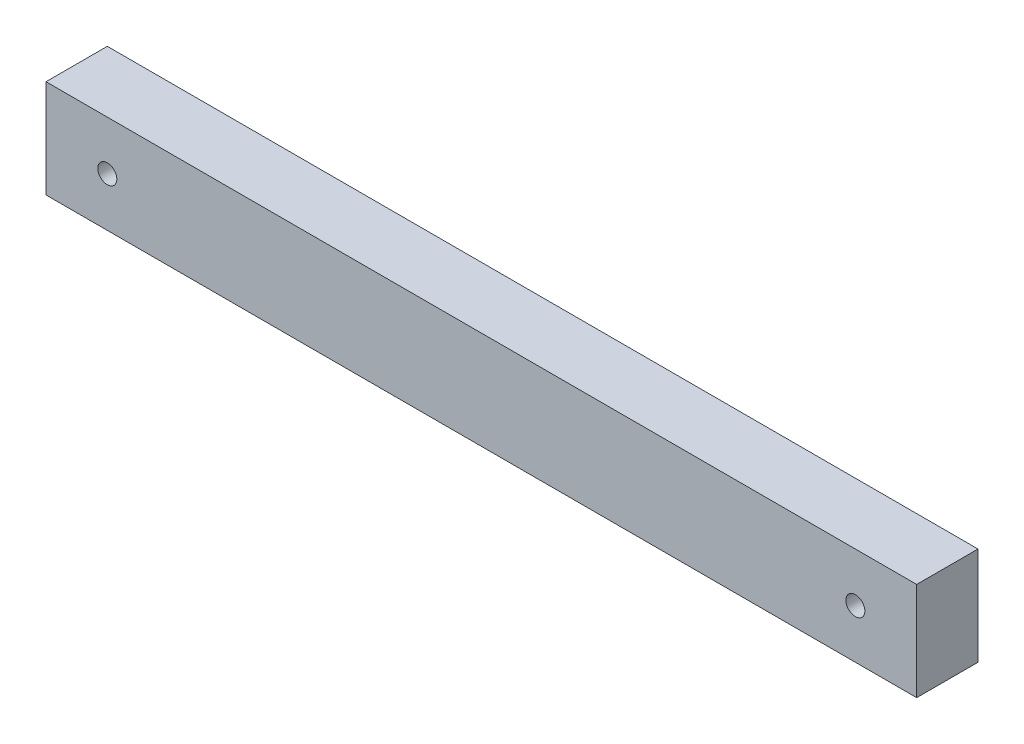
ISO-10303-21;
HEADER;
FILE_DESCRIPTION(('STEP AP214'),'2;1');
FILE_NAME('part.step','',(''),(''),'','','');
FILE_SCHEMA(('AUTOMOTIVE_DESIGN { 1 0 10303 214 1 1 1 1 }'));
ENDSEC;
DATA;
#1=APPLICATION_CONTEXT('core data for automotive mechanical design processes');
#2=APPLICATION_PROTOCOL_DEFINITION('international standard','automotive_design',2000,#1);
#3=PRODUCT_CONTEXT('',#1,'mechanical');
#4=PRODUCT('Part','Part','',(#3));
#5=PRODUCT_RELATED_PRODUCT_CATEGORY('part','',(#4));
#6=PRODUCT_DEFINITION_FORMATION('','',#4);
#7=PRODUCT_DEFINITION_CONTEXT('part definition',#1,'design');
#8=PRODUCT_DEFINITION('design','',#6,#7);
#9=PRODUCT_DEFINITION_SHAPE('','',#8);
#10=(LENGTH_UNIT() NAMED_UNIT(*) SI_UNIT(.MILLI.,.METRE.));
#11=(NAMED_UNIT(*) PLANE_ANGLE_UNIT() SI_UNIT($,.RADIAN.));
#12=(NAMED_UNIT(*) SI_UNIT($,.STERADIAN.) SOLID_ANGLE_UNIT());
#13=UNCERTAINTY_MEASURE_WITH_UNIT(LENGTH_MEASURE(1.E-05),#10,'distance_accuracy_value','');
#14=(GEOMETRIC_REPRESENTATION_CONTEXT(3) GLOBAL_UNCERTAINTY_ASSIGNED_CONTEXT((#13)) GLOBAL_UNIT_ASSIGNED_CONTEXT((#10,
#11,#12)) REPRESENTATION_CONTEXT('',''));
#15=CARTESIAN_POINT('',(0.,0.,0.));
#16=DIRECTION('',(0.,0.,1.));
#17=DIRECTION('',(1.,0.,0.));
#18=AXIS2_PLACEMENT_3D('',#15,#16,#17);
#19=CARTESIAN_POINT('',(0.,0.,10.));
#20=DIRECTION('',(0.,0.,1.));
#21=DIRECTION('',(1.,0.,0.));
#22=AXIS2_PLACEMENT_3D('',#19,#20,#21);
#23=PLANE('',#22);
#24=CARTESIAN_POINT('',(-61.,0.,10.));
#25=DIRECTION('',(0.,0.,1.));
#26=DIRECTION('',(1.,0.,0.));
#27=AXIS2_PLACEMENT_3D('',#24,#25,#26);
#28=CIRCLE('',#27,1.54999999999999);
#29=CARTESIAN_POINT('',(-59.45,0.,10.));
#30=VERTEX_POINT('',#29);
#31=EDGE_CURVE('E105',#30,#30,#28,.T.);
#32=ORIENTED_EDGE('',*,*,#31,.F.);
#33=EDGE_LOOP('',(#32));
#34=FACE_BOUND('',#33,.T.);
#35=DIRECTION('',(0.,1.,0.));
#36=VECTOR('',#35,1.);
#37=CARTESIAN_POINT('',(71.,8.00000000000004,10.));
#38=LINE('',#37,#36);
#39=CARTESIAN_POINT('',(71.,-8.00000000000004,10.));
#40=VERTEX_POINT('',#39);
#41=CARTESIAN_POINT('',(71.,8.00000000000004,10.));
#42=VERTEX_POINT('',#41);
#43=EDGE_CURVE('E90',#40,#42,#38,.T.);
#44=ORIENTED_EDGE('',*,*,#43,.T.);
#45=DIRECTION('',(-1.,0.,0.));
#46=VECTOR('',#45,1.);
#47=CARTESIAN_POINT('',(-71.,8.,10.));
#48=LINE('',#47,#46);
#49=CARTESIAN_POINT('',(-71.,8.,10.));
#50=VERTEX_POINT('',#49);
#51=EDGE_CURVE('E85',#42,#50,#48,.T.);
#52=ORIENTED_EDGE('',*,*,#51,.T.);
#53=DIRECTION('',(0.,-1.,0.));
#54=VECTOR('',#53,1.);
#55=CARTESIAN_POINT('',(-71.,8.,10.));
#56=LINE('',#55,#54);
#57=CARTESIAN_POINT('',(-71.,-8.,10.));
#58=VERTEX_POINT('',#57);
#59=EDGE_CURVE('E88',#50,#58,#56,.T.);
#60=ORIENTED_EDGE('',*,*,#59,.T.);
#61=DIRECTION('',(1.,0.,0.));
#62=VECTOR('',#61,1.);
#63=CARTESIAN_POINT('',(-71.,-8.,10.));
#64=LINE('',#63,#62);
#65=EDGE_CURVE('E55',#58,#40,#64,.T.);
#66=ORIENTED_EDGE('',*,*,#65,.T.);
#67=EDGE_LOOP('',(#44,#52,#60,#66));
#68=FACE_BOUND('',#67,.T.);
#69=CARTESIAN_POINT('',(61.,0.,10.));
#70=DIRECTION('',(0.,0.,1.));
#71=DIRECTION('',(1.,0.,0.));
#72=AXIS2_PLACEMENT_3D('',#69,#70,#71);
#73=CIRCLE('',#72,1.54999999999999);
#74=CARTESIAN_POINT('',(62.55,0.,10.));
#75=VERTEX_POINT('',#74);
#76=EDGE_CURVE('E120',#75,#75,#73,.T.);
#77=ORIENTED_EDGE('',*,*,#76,.F.);
#78=EDGE_LOOP('',(#77));
#79=FACE_BOUND('',#78,.T.);
#80=ADVANCED_FACE('F38',(#34,#68,#79),#23,.T.);
#81=CARTESIAN_POINT('',(0.,0.,0.));
#82=DIRECTION('',(0.,0.,1.));
#83=DIRECTION('',(1.,0.,0.));
#84=AXIS2_PLACEMENT_3D('',#81,#82,#83);
#85=PLANE('',#84);
#86=DIRECTION('',(0.,1.,0.));
#87=VECTOR('',#86,1.);
#88=CARTESIAN_POINT('',(71.,8.00000000000004,0.));
#89=LINE('',#88,#87);
#90=CARTESIAN_POINT('',(71.,-8.00000000000004,0.));
#91=VERTEX_POINT('',#90);
#92=CARTESIAN_POINT('',(71.,8.00000000000004,0.));
#93=VERTEX_POINT('',#92);
#94=EDGE_CURVE('E102',#91,#93,#89,.T.);
#95=ORIENTED_EDGE('',*,*,#94,.F.);
#96=DIRECTION('',(1.,0.,0.));
#97=VECTOR('',#96,1.);
#98=CARTESIAN_POINT('',(-71.,-8.,0.));
#99=LINE('',#98,#97);
#100=CARTESIAN_POINT('',(-71.,-8.,0.));
#101=VERTEX_POINT('',#100);
#102=EDGE_CURVE('E78',#101,#91,#99,.T.);
#103=ORIENTED_EDGE('',*,*,#102,.F.);
#104=DIRECTION('',(0.,-1.,0.));
#105=VECTOR('',#104,1.);
#106=CARTESIAN_POINT('',(-71.,8.,0.));
#107=LINE('',#106,#105);
#108=CARTESIAN_POINT('',(-71.,8.,0.));
#109=VERTEX_POINT('',#108);
#110=EDGE_CURVE('E72',#109,#101,#107,.T.);
#111=ORIENTED_EDGE('',*,*,#110,.F.);
#112=DIRECTION('',(-1.,0.,0.));
#113=VECTOR('',#112,1.);
#114=CARTESIAN_POINT('',(-71.,8.,0.));
#115=LINE('',#114,#113);
#116=EDGE_CURVE('E94',#93,#109,#115,.T.);
#117=ORIENTED_EDGE('',*,*,#116,.F.);
#118=EDGE_LOOP('',(#95,#103,#111,#117));
#119=FACE_BOUND('',#118,.T.);
#120=CARTESIAN_POINT('',(-61.,0.,0.));
#121=DIRECTION('',(0.,0.,1.));
#122=DIRECTION('',(1.,0.,0.));
#123=AXIS2_PLACEMENT_3D('',#120,#121,#122);
#124=CIRCLE('',#123,1.54999999999999);
#125=CARTESIAN_POINT('',(-59.45,0.,0.));
#126=VERTEX_POINT('',#125);
#127=EDGE_CURVE('E117',#126,#126,#124,.T.);
#128=ORIENTED_EDGE('',*,*,#127,.T.);
#129=EDGE_LOOP('',(#128));
#130=FACE_BOUND('',#129,.T.);
#131=CARTESIAN_POINT('',(61.,0.,0.));
#132=DIRECTION('',(0.,0.,1.));
#133=DIRECTION('',(1.,0.,0.));
#134=AXIS2_PLACEMENT_3D('',#131,#132,#133);
#135=CIRCLE('',#134,1.54999999999999);
#136=CARTESIAN_POINT('',(62.55,0.,0.));
#137=VERTEX_POINT('',#136);
#138=EDGE_CURVE('E123',#137,#137,#135,.T.);
#139=ORIENTED_EDGE('',*,*,#138,.T.);
#140=EDGE_LOOP('',(#139));
#141=FACE_BOUND('',#140,.T.);
#142=ADVANCED_FACE('F113',(#119,#130,#141),#85,.F.);
#143=CARTESIAN_POINT('',(71.,8.00000000000004,10.));
#144=DIRECTION('',(-1.,0.,0.));
#145=DIRECTION('',(0.,0.,1.));
#146=AXIS2_PLACEMENT_3D('',#143,#144,#145);
#147=PLANE('',#146);
#148=ORIENTED_EDGE('',*,*,#94,.T.);
#149=DIRECTION('',(0.,0.,-1.));
#150=VECTOR('',#149,1.);
#151=CARTESIAN_POINT('',(71.,8.00000000000004,10.));
#152=LINE('',#151,#150);
#153=EDGE_CURVE('E11',#42,#93,#152,.T.);
#154=ORIENTED_EDGE('',*,*,#153,.F.);
#155=ORIENTED_EDGE('',*,*,#43,.F.);
#156=DIRECTION('',(0.,0.,-1.));
#157=VECTOR('',#156,1.);
#158=CARTESIAN_POINT('',(71.,-8.00000000000004,10.));
#159=LINE('',#158,#157);
#160=EDGE_CURVE('E98',#40,#91,#159,.T.);
#161=ORIENTED_EDGE('',*,*,#160,.T.);
#162=EDGE_LOOP('',(#148,#154,#155,#161));
#163=FACE_BOUND('',#162,.T.);
#164=ADVANCED_FACE('F40',(#163),#147,.F.);
#165=CARTESIAN_POINT('',(-71.,8.,10.));
#166=DIRECTION('',(0.,-1.,0.));
#167=DIRECTION('',(1.,0.,0.));
#168=AXIS2_PLACEMENT_3D('',#165,#166,#167);
#169=PLANE('',#168);
#170=ORIENTED_EDGE('',*,*,#116,.T.);
#171=DIRECTION('',(0.,0.,-1.));
#172=VECTOR('',#171,1.);
#173=CARTESIAN_POINT('',(-71.,8.,10.));
#174=LINE('',#173,#172);
#175=EDGE_CURVE('E47',#50,#109,#174,.T.);
#176=ORIENTED_EDGE('',*,*,#175,.F.);
#177=ORIENTED_EDGE('',*,*,#51,.F.);
#178=ORIENTED_EDGE('',*,*,#153,.T.);
#179=EDGE_LOOP('',(#170,#176,#177,#178));
#180=FACE_BOUND('',#179,.T.);
#181=ADVANCED_FACE('F93',(#180),#169,.F.);
#182=CARTESIAN_POINT('',(-71.,8.,10.));
#183=DIRECTION('',(1.,0.,0.));
#184=DIRECTION('',(0.,0.,-1.));
#185=AXIS2_PLACEMENT_3D('',#182,#183,#184);
#186=PLANE('',#185);
#187=ORIENTED_EDGE('',*,*,#110,.T.);
#188=DIRECTION('',(0.,0.,-1.));
#189=VECTOR('',#188,1.);
#190=CARTESIAN_POINT('',(-71.,-8.,10.));
#191=LINE('',#190,#189);
#192=EDGE_CURVE('E95',#58,#101,#191,.T.);
#193=ORIENTED_EDGE('',*,*,#192,.F.);
#194=ORIENTED_EDGE('',*,*,#59,.F.);
#195=ORIENTED_EDGE('',*,*,#175,.T.);
#196=EDGE_LOOP('',(#187,#193,#194,#195));
#197=FACE_BOUND('',#196,.T.);
#198=ADVANCED_FACE('F96',(#197),#186,.F.);
#199=CARTESIAN_POINT('',(-71.,-8.,10.));
#200=DIRECTION('',(0.,1.,0.));
#201=DIRECTION('',(-1.,0.,0.));
#202=AXIS2_PLACEMENT_3D('',#199,#200,#201);
#203=PLANE('',#202);
#204=ORIENTED_EDGE('',*,*,#102,.T.);
#205=ORIENTED_EDGE('',*,*,#160,.F.);
#206=ORIENTED_EDGE('',*,*,#65,.F.);
#207=ORIENTED_EDGE('',*,*,#192,.T.);
#208=EDGE_LOOP('',(#204,#205,#206,#207));
#209=FACE_BOUND('',#208,.T.);
#210=ADVANCED_FACE('F110',(#209),#203,.F.);
#211=CARTESIAN_POINT('',(-61.,0.,10.));
#212=DIRECTION('',(0.,0.,-1.));
#213=DIRECTION('',(-1.,0.,0.));
#214=AXIS2_PLACEMENT_3D('',#211,#212,#213);
#215=CYLINDRICAL_SURFACE('',#214,1.54999999999999);
#216=ORIENTED_EDGE('',*,*,#31,.T.);
#217=EDGE_LOOP('',(#216));
#218=FACE_BOUND('',#217,.T.);
#219=ORIENTED_EDGE('',*,*,#127,.F.);
#220=EDGE_LOOP('',(#219));
#221=FACE_BOUND('',#220,.T.);
#222=ADVANCED_FACE('F140',(#218,#221),#215,.F.);
#223=CARTESIAN_POINT('',(61.,0.,10.));
#224=DIRECTION('',(0.,0.,-1.));
#225=DIRECTION('',(-1.,0.,0.));
#226=AXIS2_PLACEMENT_3D('',#223,#224,#225);
#227=CYLINDRICAL_SURFACE('',#226,1.54999999999999);
#228=ORIENTED_EDGE('',*,*,#76,.T.);
#229=EDGE_LOOP('',(#228));
#230=FACE_BOUND('',#229,.T.);
#231=ORIENTED_EDGE('',*,*,#138,.F.);
#232=EDGE_LOOP('',(#231));
#233=FACE_BOUND('',#232,.T.);
#234=ADVANCED_FACE('F129',(#230,#233),#227,.F.);
#235=CLOSED_SHELL('',(#80,#142,#164,#181,#198,#210,#222,#234));
#236=MANIFOLD_SOLID_BREP('B2',#235);
#237=ADVANCED_BREP_SHAPE_REPRESENTATION('',(#18,#236),#14);
#238=SHAPE_DEFINITION_REPRESENTATION(#9,#237);
ENDSEC;
END-ISO-10303-21;
